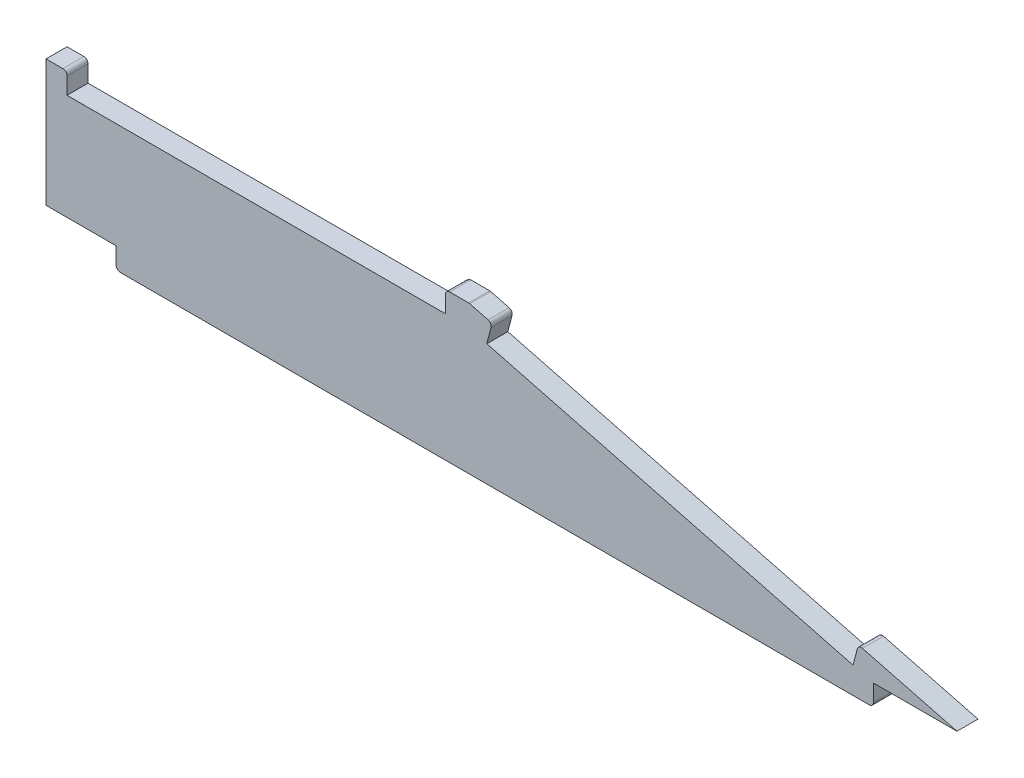
ISO-10303-21;
HEADER;
FILE_DESCRIPTION(('STEP AP214'),'2;1');
FILE_NAME('part.step','',(''),(''),'','','');
FILE_SCHEMA(('AUTOMOTIVE_DESIGN { 1 0 10303 214 1 1 1 1 }'));
ENDSEC;
DATA;
#1=APPLICATION_CONTEXT('core data for automotive mechanical design processes');
#2=APPLICATION_PROTOCOL_DEFINITION('international standard','automotive_design',2000,#1);
#3=PRODUCT_CONTEXT('',#1,'mechanical');
#4=PRODUCT('Part','Part','',(#3));
#5=PRODUCT_RELATED_PRODUCT_CATEGORY('part','',(#4));
#6=PRODUCT_DEFINITION_FORMATION('','',#4);
#7=PRODUCT_DEFINITION_CONTEXT('part definition',#1,'design');
#8=PRODUCT_DEFINITION('design','',#6,#7);
#9=PRODUCT_DEFINITION_SHAPE('','',#8);
#10=(LENGTH_UNIT() NAMED_UNIT(*) SI_UNIT(.MILLI.,.METRE.));
#11=(NAMED_UNIT(*) PLANE_ANGLE_UNIT() SI_UNIT($,.RADIAN.));
#12=(NAMED_UNIT(*) SI_UNIT($,.STERADIAN.) SOLID_ANGLE_UNIT());
#13=UNCERTAINTY_MEASURE_WITH_UNIT(LENGTH_MEASURE(1.E-05),#10,'distance_accuracy_value','');
#14=(GEOMETRIC_REPRESENTATION_CONTEXT(3) GLOBAL_UNCERTAINTY_ASSIGNED_CONTEXT((#13)) GLOBAL_UNIT_ASSIGNED_CONTEXT((#10,
#11,#12)) REPRESENTATION_CONTEXT('',''));
#15=CARTESIAN_POINT('',(0.,0.,0.));
#16=DIRECTION('',(0.,0.,1.));
#17=DIRECTION('',(1.,0.,0.));
#18=AXIS2_PLACEMENT_3D('',#15,#16,#17);
#19=CARTESIAN_POINT('',(124.40519424105,35.1608545699395,5.));
#20=DIRECTION('',(0.,-1.,0.));
#21=DIRECTION('',(0.,0.,-1.));
#22=AXIS2_PLACEMENT_3D('',#19,#20,#21);
#23=PLANE('',#22);
#24=DIRECTION('',(-1.,0.,0.));
#25=VECTOR('',#24,1.);
#26=CARTESIAN_POINT('',(124.40519424105,35.1608545699395,0.));
#27=LINE('',#26,#25);
#28=CARTESIAN_POINT('',(129.916638141311,35.1608545699395,0.));
#29=VERTEX_POINT('',#28);
#30=CARTESIAN_POINT('',(125.40519424105,35.1608545699395,0.));
#31=VERTEX_POINT('',#30);
#32=EDGE_CURVE('E255',#29,#31,#27,.T.);
#33=ORIENTED_EDGE('',*,*,#32,.T.);
#34=DIRECTION('',(0.,0.,-1.));
#35=VECTOR('',#34,1.);
#36=CARTESIAN_POINT('',(125.40519424105,35.1608545699395,5.));
#37=LINE('',#36,#35);
#38=CARTESIAN_POINT('',(125.40519424105,35.1608545699395,5.));
#39=VERTEX_POINT('',#38);
#40=EDGE_CURVE('E358',#31,#39,#37,.F.);
#41=ORIENTED_EDGE('',*,*,#40,.T.);
#42=DIRECTION('',(-1.,0.,0.));
#43=VECTOR('',#42,1.);
#44=CARTESIAN_POINT('',(124.40519424105,35.1608545699395,5.));
#45=LINE('',#44,#43);
#46=CARTESIAN_POINT('',(129.916638141311,35.1608545699395,5.));
#47=VERTEX_POINT('',#46);
#48=EDGE_CURVE('E208',#47,#39,#45,.T.);
#49=ORIENTED_EDGE('',*,*,#48,.F.);
#50=DIRECTION('',(0.,0.,-1.));
#51=VECTOR('',#50,1.);
#52=CARTESIAN_POINT('',(129.916638141311,35.1608545699395,5.));
#53=LINE('',#52,#51);
#54=EDGE_CURVE('E355',#47,#29,#53,.T.);
#55=ORIENTED_EDGE('',*,*,#54,.T.);
#56=EDGE_LOOP('',(#33,#41,#49,#55));
#57=FACE_BOUND('',#56,.T.);
#58=ADVANCED_FACE('F40',(#57),#23,.F.);
#59=CARTESIAN_POINT('',(124.40519424105,35.1608545699395,5.));
#60=DIRECTION('',(1.,0.,0.));
#61=DIRECTION('',(0.,0.,-1.));
#62=AXIS2_PLACEMENT_3D('',#59,#60,#61);
#63=PLANE('',#62);
#64=DIRECTION('',(0.,-1.,0.));
#65=VECTOR('',#64,1.);
#66=CARTESIAN_POINT('',(124.40519424105,35.1608545699395,5.));
#67=LINE('',#66,#65);
#68=CARTESIAN_POINT('',(124.40519424105,34.1608545699395,5.));
#69=VERTEX_POINT('',#68);
#70=CARTESIAN_POINT('',(124.40519424105,30.1608545699395,5.));
#71=VERTEX_POINT('',#70);
#72=EDGE_CURVE('E194',#69,#71,#67,.T.);
#73=ORIENTED_EDGE('',*,*,#72,.F.);
#74=DIRECTION('',(0.,0.,-1.));
#75=VECTOR('',#74,1.);
#76=CARTESIAN_POINT('',(124.40519424105,34.1608545699395,5.));
#77=LINE('',#76,#75);
#78=CARTESIAN_POINT('',(124.40519424105,34.1608545699395,0.));
#79=VERTEX_POINT('',#78);
#80=EDGE_CURVE('E353',#69,#79,#77,.T.);
#81=ORIENTED_EDGE('',*,*,#80,.T.);
#82=DIRECTION('',(0.,-1.,0.));
#83=VECTOR('',#82,1.);
#84=CARTESIAN_POINT('',(124.40519424105,35.1608545699395,0.));
#85=LINE('',#84,#83);
#86=CARTESIAN_POINT('',(124.40519424105,30.1608545699395,0.));
#87=VERTEX_POINT('',#86);
#88=EDGE_CURVE('E214',#79,#87,#85,.T.);
#89=ORIENTED_EDGE('',*,*,#88,.T.);
#90=DIRECTION('',(0.,0.,-1.));
#91=VECTOR('',#90,1.);
#92=CARTESIAN_POINT('',(124.40519424105,30.1608545699395,5.));
#93=LINE('',#92,#91);
#94=EDGE_CURVE('E211',#71,#87,#93,.T.);
#95=ORIENTED_EDGE('',*,*,#94,.F.);
#96=EDGE_LOOP('',(#73,#81,#89,#95));
#97=FACE_BOUND('',#96,.T.);
#98=ADVANCED_FACE('F212',(#97),#63,.F.);
#99=CARTESIAN_POINT('',(34.4051942410499,30.1608545699394,5.));
#100=DIRECTION('',(0.,-1.,0.));
#101=DIRECTION('',(1.,0.,0.));
#102=AXIS2_PLACEMENT_3D('',#99,#100,#101);
#103=PLANE('',#102);
#104=DIRECTION('',(-1.,0.,0.));
#105=VECTOR('',#104,1.);
#106=CARTESIAN_POINT('',(34.4051942410499,30.1608545699394,0.));
#107=LINE('',#106,#105);
#108=CARTESIAN_POINT('',(34.4051942410499,30.1608545699394,0.));
#109=VERTEX_POINT('',#108);
#110=EDGE_CURVE('E259',#87,#109,#107,.T.);
#111=ORIENTED_EDGE('',*,*,#110,.T.);
#112=DIRECTION('',(0.,0.,-1.));
#113=VECTOR('',#112,1.);
#114=CARTESIAN_POINT('',(34.4051942410499,30.1608545699394,5.));
#115=LINE('',#114,#113);
#116=CARTESIAN_POINT('',(34.4051942410499,30.1608545699394,5.));
#117=VERTEX_POINT('',#116);
#118=EDGE_CURVE('E218',#117,#109,#115,.T.);
#119=ORIENTED_EDGE('',*,*,#118,.F.);
#120=DIRECTION('',(-1.,0.,0.));
#121=VECTOR('',#120,1.);
#122=CARTESIAN_POINT('',(34.4051942410499,30.1608545699394,5.));
#123=LINE('',#122,#121);
#124=EDGE_CURVE('E200',#71,#117,#123,.T.);
#125=ORIENTED_EDGE('',*,*,#124,.F.);
#126=ORIENTED_EDGE('',*,*,#94,.T.);
#127=EDGE_LOOP('',(#111,#119,#125,#126));
#128=FACE_BOUND('',#127,.T.);
#129=ADVANCED_FACE('F220',(#128),#103,.F.);
#130=CARTESIAN_POINT('',(34.4051942410499,35.1608545699395,5.));
#131=DIRECTION('',(-1.,0.,0.));
#132=DIRECTION('',(0.,0.,1.));
#133=AXIS2_PLACEMENT_3D('',#130,#131,#132);
#134=PLANE('',#133);
#135=DIRECTION('',(0.,1.,0.));
#136=VECTOR('',#135,1.);
#137=CARTESIAN_POINT('',(34.4051942410499,35.1608545699395,0.));
#138=LINE('',#137,#136);
#139=CARTESIAN_POINT('',(34.4051942410499,34.1608545699395,0.));
#140=VERTEX_POINT('',#139);
#141=EDGE_CURVE('E261',#109,#140,#138,.T.);
#142=ORIENTED_EDGE('',*,*,#141,.T.);
#143=DIRECTION('',(0.,0.,-1.));
#144=VECTOR('',#143,1.);
#145=CARTESIAN_POINT('',(34.4051942410499,34.1608545699395,5.));
#146=LINE('',#145,#144);
#147=CARTESIAN_POINT('',(34.4051942410499,34.1608545699395,5.));
#148=VERTEX_POINT('',#147);
#149=EDGE_CURVE('E351',#140,#148,#146,.F.);
#150=ORIENTED_EDGE('',*,*,#149,.T.);
#151=DIRECTION('',(0.,1.,0.));
#152=VECTOR('',#151,1.);
#153=CARTESIAN_POINT('',(34.4051942410499,35.1608545699395,5.));
#154=LINE('',#153,#152);
#155=EDGE_CURVE('E223',#117,#148,#154,.T.);
#156=ORIENTED_EDGE('',*,*,#155,.F.);
#157=ORIENTED_EDGE('',*,*,#118,.T.);
#158=EDGE_LOOP('',(#142,#150,#156,#157));
#159=FACE_BOUND('',#158,.T.);
#160=ADVANCED_FACE('F405',(#159),#134,.F.);
#161=CARTESIAN_POINT('',(34.4051942410499,35.1608545699395,5.));
#162=DIRECTION('',(0.,-1.,0.));
#163=DIRECTION('',(0.,0.,-1.));
#164=AXIS2_PLACEMENT_3D('',#161,#162,#163);
#165=PLANE('',#164);
#166=DIRECTION('',(-1.,0.,0.));
#167=VECTOR('',#166,1.);
#168=CARTESIAN_POINT('',(34.4051942410499,35.1608545699395,5.));
#169=LINE('',#168,#167);
#170=CARTESIAN_POINT('',(33.4051942410499,35.1608545699395,5.));
#171=VERTEX_POINT('',#170);
#172=CARTESIAN_POINT('',(29.4051942410499,35.1608545699395,5.));
#173=VERTEX_POINT('',#172);
#174=EDGE_CURVE('E225',#171,#173,#169,.T.);
#175=ORIENTED_EDGE('',*,*,#174,.F.);
#176=DIRECTION('',(0.,0.,-1.));
#177=VECTOR('',#176,1.);
#178=CARTESIAN_POINT('',(33.4051942410499,35.1608545699395,5.));
#179=LINE('',#178,#177);
#180=CARTESIAN_POINT('',(33.4051942410499,35.1608545699395,0.));
#181=VERTEX_POINT('',#180);
#182=EDGE_CURVE('E348',#171,#181,#179,.T.);
#183=ORIENTED_EDGE('',*,*,#182,.T.);
#184=DIRECTION('',(-1.,0.,0.));
#185=VECTOR('',#184,1.);
#186=CARTESIAN_POINT('',(34.4051942410499,35.1608545699395,0.));
#187=LINE('',#186,#185);
#188=CARTESIAN_POINT('',(29.4051942410499,35.1608545699395,0.));
#189=VERTEX_POINT('',#188);
#190=EDGE_CURVE('E264',#181,#189,#187,.T.);
#191=ORIENTED_EDGE('',*,*,#190,.T.);
#192=DIRECTION('',(0.,0.,-1.));
#193=VECTOR('',#192,1.);
#194=CARTESIAN_POINT('',(29.4051942410499,35.1608545699395,5.));
#195=LINE('',#194,#193);
#196=EDGE_CURVE('E309',#173,#189,#195,.T.);
#197=ORIENTED_EDGE('',*,*,#196,.F.);
#198=EDGE_LOOP('',(#175,#183,#191,#197));
#199=FACE_BOUND('',#198,.T.);
#200=ADVANCED_FACE('F414',(#199),#165,.F.);
#201=CARTESIAN_POINT('',(29.4051942410499,35.1608545699395,5.));
#202=DIRECTION('',(1.,0.,0.));
#203=DIRECTION('',(0.,1.,0.));
#204=AXIS2_PLACEMENT_3D('',#201,#202,#203);
#205=PLANE('',#204);
#206=DIRECTION('',(0.,-1.,0.));
#207=VECTOR('',#206,1.);
#208=CARTESIAN_POINT('',(29.4051942410499,35.1608545699395,0.));
#209=LINE('',#208,#207);
#210=CARTESIAN_POINT('',(29.4051942410499,5.00000000000002,0.));
#211=VERTEX_POINT('',#210);
#212=EDGE_CURVE('E266',#189,#211,#209,.T.);
#213=ORIENTED_EDGE('',*,*,#212,.T.);
#214=DIRECTION('',(0.,0.,-1.));
#215=VECTOR('',#214,1.);
#216=CARTESIAN_POINT('',(29.4051942410499,5.00000000000002,5.));
#217=LINE('',#216,#215);
#218=CARTESIAN_POINT('',(29.4051942410499,5.00000000000002,5.));
#219=VERTEX_POINT('',#218);
#220=EDGE_CURVE('E306',#219,#211,#217,.T.);
#221=ORIENTED_EDGE('',*,*,#220,.F.);
#222=DIRECTION('',(0.,-1.,0.));
#223=VECTOR('',#222,1.);
#224=CARTESIAN_POINT('',(29.4051942410499,35.1608545699395,5.));
#225=LINE('',#224,#223);
#226=EDGE_CURVE('E230',#173,#219,#225,.T.);
#227=ORIENTED_EDGE('',*,*,#226,.F.);
#228=ORIENTED_EDGE('',*,*,#196,.T.);
#229=EDGE_LOOP('',(#213,#221,#227,#228));
#230=FACE_BOUND('',#229,.T.);
#231=ADVANCED_FACE('F421',(#230),#205,.F.);
#232=CARTESIAN_POINT('',(29.4051942410499,5.00000000000002,5.));
#233=DIRECTION('',(0.,1.,0.));
#234=DIRECTION('',(0.,0.,1.));
#235=AXIS2_PLACEMENT_3D('',#232,#233,#234);
#236=PLANE('',#235);
#237=DIRECTION('',(1.,0.,0.));
#238=VECTOR('',#237,1.);
#239=CARTESIAN_POINT('',(29.4051942410499,5.00000000000002,0.));
#240=LINE('',#239,#238);
#241=CARTESIAN_POINT('',(46.0881028422609,5.00000000000002,0.));
#242=VERTEX_POINT('',#241);
#243=EDGE_CURVE('E268',#211,#242,#240,.T.);
#244=ORIENTED_EDGE('',*,*,#243,.T.);
#245=DIRECTION('',(0.,0.,-1.));
#246=VECTOR('',#245,1.);
#247=CARTESIAN_POINT('',(46.0881028422609,5.00000000000002,5.));
#248=LINE('',#247,#246);
#249=CARTESIAN_POINT('',(46.0881028422609,5.00000000000002,5.));
#250=VERTEX_POINT('',#249);
#251=EDGE_CURVE('E303',#250,#242,#248,.T.);
#252=ORIENTED_EDGE('',*,*,#251,.F.);
#253=DIRECTION('',(1.,0.,0.));
#254=VECTOR('',#253,1.);
#255=CARTESIAN_POINT('',(29.4051942410499,5.00000000000002,5.));
#256=LINE('',#255,#254);
#257=EDGE_CURVE('E232',#219,#250,#256,.T.);
#258=ORIENTED_EDGE('',*,*,#257,.F.);
#259=ORIENTED_EDGE('',*,*,#220,.T.);
#260=EDGE_LOOP('',(#244,#252,#258,#259));
#261=FACE_BOUND('',#260,.T.);
#262=ADVANCED_FACE('F425',(#261),#236,.F.);
#263=CARTESIAN_POINT('',(46.0881028422609,5.00000000000002,5.));
#264=DIRECTION('',(1.,0.,0.));
#265=DIRECTION('',(0.,0.,-1.));
#266=AXIS2_PLACEMENT_3D('',#263,#264,#265);
#267=PLANE('',#266);
#268=DIRECTION('',(0.,-1.,0.));
#269=VECTOR('',#268,1.);
#270=CARTESIAN_POINT('',(46.0881028422609,5.00000000000002,0.));
#271=LINE('',#270,#269);
#272=CARTESIAN_POINT('',(46.0881028422609,1.00000000000003,0.));
#273=VERTEX_POINT('',#272);
#274=EDGE_CURVE('E270',#242,#273,#271,.T.);
#275=ORIENTED_EDGE('',*,*,#274,.T.);
#276=DIRECTION('',(0.,0.,-1.));
#277=VECTOR('',#276,1.);
#278=CARTESIAN_POINT('',(46.0881028422609,1.00000000000003,5.));
#279=LINE('',#278,#277);
#280=CARTESIAN_POINT('',(46.0881028422609,1.00000000000003,5.));
#281=VERTEX_POINT('',#280);
#282=EDGE_CURVE('E346',#273,#281,#279,.F.);
#283=ORIENTED_EDGE('',*,*,#282,.T.);
#284=DIRECTION('',(0.,-1.,0.));
#285=VECTOR('',#284,1.);
#286=CARTESIAN_POINT('',(46.0881028422609,5.00000000000002,5.));
#287=LINE('',#286,#285);
#288=EDGE_CURVE('E234',#250,#281,#287,.T.);
#289=ORIENTED_EDGE('',*,*,#288,.F.);
#290=ORIENTED_EDGE('',*,*,#251,.T.);
#291=EDGE_LOOP('',(#275,#283,#289,#290));
#292=FACE_BOUND('',#291,.T.);
#293=ADVANCED_FACE('F586',(#292),#267,.F.);
#294=CARTESIAN_POINT('',(46.0881028422609,0.,5.));
#295=DIRECTION('',(0.,1.,0.));
#296=DIRECTION('',(0.,0.,1.));
#297=AXIS2_PLACEMENT_3D('',#294,#295,#296);
#298=PLANE('',#297);
#299=DIRECTION('',(1.,0.,0.));
#300=VECTOR('',#299,1.);
#301=CARTESIAN_POINT('',(46.0881028422609,0.,0.));
#302=LINE('',#301,#300);
#303=CARTESIAN_POINT('',(47.0881028422609,0.,0.));
#304=VERTEX_POINT('',#303);
#305=CARTESIAN_POINT('',(225.188102842261,0.,0.));
#306=VERTEX_POINT('',#305);
#307=EDGE_CURVE('E273',#304,#306,#302,.T.);
#308=ORIENTED_EDGE('',*,*,#307,.T.);
#309=DIRECTION('',(0.,0.,-1.));
#310=VECTOR('',#309,1.);
#311=CARTESIAN_POINT('',(225.188102842261,0.,5.));
#312=LINE('',#311,#310);
#313=CARTESIAN_POINT('',(225.188102842261,0.,5.));
#314=VERTEX_POINT('',#313);
#315=EDGE_CURVE('E332',#306,#314,#312,.F.);
#316=ORIENTED_EDGE('',*,*,#315,.T.);
#317=DIRECTION('',(1.,0.,0.));
#318=VECTOR('',#317,1.);
#319=CARTESIAN_POINT('',(46.0881028422609,0.,5.));
#320=LINE('',#319,#318);
#321=CARTESIAN_POINT('',(47.0881028422609,0.,5.));
#322=VERTEX_POINT('',#321);
#323=EDGE_CURVE('E237',#322,#314,#320,.T.);
#324=ORIENTED_EDGE('',*,*,#323,.F.);
#325=DIRECTION('',(0.,0.,-1.));
#326=VECTOR('',#325,1.);
#327=CARTESIAN_POINT('',(47.0881028422609,0.,5.));
#328=LINE('',#327,#326);
#329=EDGE_CURVE('E329',#322,#304,#328,.T.);
#330=ORIENTED_EDGE('',*,*,#329,.T.);
#331=EDGE_LOOP('',(#308,#316,#324,#330));
#332=FACE_BOUND('',#331,.T.);
#333=ADVANCED_FACE('F437',(#332),#298,.F.);
#334=CARTESIAN_POINT('',(226.188102842261,5.00000000000002,5.));
#335=DIRECTION('',(-1.,0.,0.));
#336=DIRECTION('',(0.,0.,1.));
#337=AXIS2_PLACEMENT_3D('',#334,#335,#336);
#338=PLANE('',#337);
#339=DIRECTION('',(0.,1.,0.));
#340=VECTOR('',#339,1.);
#341=CARTESIAN_POINT('',(226.188102842261,5.00000000000002,5.));
#342=LINE('',#341,#340);
#343=CARTESIAN_POINT('',(226.188102842261,1.00000000000003,5.));
#344=VERTEX_POINT('',#343);
#345=CARTESIAN_POINT('',(226.188102842261,5.00000000000002,5.));
#346=VERTEX_POINT('',#345);
#347=EDGE_CURVE('E239',#344,#346,#342,.T.);
#348=ORIENTED_EDGE('',*,*,#347,.F.);
#349=DIRECTION('',(0.,0.,-1.));
#350=VECTOR('',#349,1.);
#351=CARTESIAN_POINT('',(226.188102842261,1.00000000000003,5.));
#352=LINE('',#351,#350);
#353=CARTESIAN_POINT('',(226.188102842261,1.00000000000003,0.));
#354=VERTEX_POINT('',#353);
#355=EDGE_CURVE('E217',#344,#354,#352,.T.);
#356=ORIENTED_EDGE('',*,*,#355,.T.);
#357=DIRECTION('',(0.,1.,0.));
#358=VECTOR('',#357,1.);
#359=CARTESIAN_POINT('',(226.188102842261,5.00000000000002,0.));
#360=LINE('',#359,#358);
#361=CARTESIAN_POINT('',(226.188102842261,5.00000000000002,0.));
#362=VERTEX_POINT('',#361);
#363=EDGE_CURVE('E276',#354,#362,#360,.T.);
#364=ORIENTED_EDGE('',*,*,#363,.T.);
#365=DIRECTION('',(0.,0.,-1.));
#366=VECTOR('',#365,1.);
#367=CARTESIAN_POINT('',(226.188102842261,5.00000000000002,5.));
#368=LINE('',#367,#366);
#369=EDGE_CURVE('E300',#346,#362,#368,.T.);
#370=ORIENTED_EDGE('',*,*,#369,.F.);
#371=EDGE_LOOP('',(#348,#356,#364,#370));
#372=FACE_BOUND('',#371,.T.);
#373=ADVANCED_FACE('F446',(#372),#338,.F.);
#374=CARTESIAN_POINT('',(226.188102842261,5.00000000000002,5.));
#375=DIRECTION('',(0.,1.,0.));
#376=DIRECTION('',(0.,0.,1.));
#377=AXIS2_PLACEMENT_3D('',#374,#375,#376);
#378=PLANE('',#377);
#379=DIRECTION('',(1.,0.,0.));
#380=VECTOR('',#379,1.);
#381=CARTESIAN_POINT('',(226.188102842261,5.00000000000002,0.));
#382=LINE('',#381,#380);
#383=CARTESIAN_POINT('',(246.060241867196,5.00000000000002,0.));
#384=VERTEX_POINT('',#383);
#385=EDGE_CURVE('E278',#362,#384,#382,.T.);
#386=ORIENTED_EDGE('',*,*,#385,.T.);
#387=DIRECTION('',(0.,0.,-1.));
#388=VECTOR('',#387,1.);
#389=CARTESIAN_POINT('',(246.060241867196,5.00000000000002,5.));
#390=LINE('',#389,#388);
#391=CARTESIAN_POINT('',(246.060241867196,5.00000000000002,5.));
#392=VERTEX_POINT('',#391);
#393=EDGE_CURVE('E297',#392,#384,#390,.T.);
#394=ORIENTED_EDGE('',*,*,#393,.F.);
#395=DIRECTION('',(1.,0.,0.));
#396=VECTOR('',#395,1.);
#397=CARTESIAN_POINT('',(226.188102842261,5.00000000000002,5.));
#398=LINE('',#397,#396);
#399=EDGE_CURVE('E241',#346,#392,#398,.T.);
#400=ORIENTED_EDGE('',*,*,#399,.F.);
#401=ORIENTED_EDGE('',*,*,#369,.T.);
#402=EDGE_LOOP('',(#386,#394,#400,#401));
#403=FACE_BOUND('',#402,.T.);
#404=ADVANCED_FACE('F452',(#403),#378,.F.);
#405=CARTESIAN_POINT('',(222.607000140697,11.0971881585575,5.));
#406=DIRECTION('',(-0.251608545699394,-0.96782908601211,0.));
#407=DIRECTION('',(0.96782908601211,-0.251608545699394,0.));
#408=AXIS2_PLACEMENT_3D('',#405,#406,#407);
#409=PLANE('',#408);
#410=DIRECTION('',(-0.96782908601211,0.251608545699394,0.));
#411=VECTOR('',#410,1.);
#412=CARTESIAN_POINT('',(222.607000140697,11.0971881585575,0.));
#413=LINE('',#412,#411);
#414=CARTESIAN_POINT('',(223.574829226709,10.8455796128581,0.));
#415=VERTEX_POINT('',#414);
#416=EDGE_CURVE('E280',#384,#415,#413,.T.);
#417=ORIENTED_EDGE('',*,*,#416,.T.);
#418=DIRECTION('',(0.,0.,-1.));
#419=VECTOR('',#418,1.);
#420=CARTESIAN_POINT('',(223.574829226709,10.8455796128581,5.));
#421=LINE('',#420,#419);
#422=CARTESIAN_POINT('',(223.574829226709,10.8455796128581,5.));
#423=VERTEX_POINT('',#422);
#424=EDGE_CURVE('E11',#415,#423,#421,.F.);
#425=ORIENTED_EDGE('',*,*,#424,.T.);
#426=DIRECTION('',(-0.96782908601211,0.251608545699394,0.));
#427=VECTOR('',#426,1.);
#428=CARTESIAN_POINT('',(222.607000140697,11.0971881585575,5.));
#429=LINE('',#428,#427);
#430=EDGE_CURVE('E243',#392,#423,#429,.T.);
#431=ORIENTED_EDGE('',*,*,#430,.F.);
#432=ORIENTED_EDGE('',*,*,#393,.T.);
#433=EDGE_LOOP('',(#417,#425,#431,#432));
#434=FACE_BOUND('',#433,.T.);
#435=ADVANCED_FACE('F454',(#434),#409,.F.);
#436=CARTESIAN_POINT('',(221.3489574122,6.25804272849701,5.));
#437=DIRECTION('',(0.96782908601211,-0.251608545699395,0.));
#438=DIRECTION('',(0.251608545699395,0.96782908601211,0.));
#439=AXIS2_PLACEMENT_3D('',#436,#437,#438);
#440=PLANE('',#439);
#441=DIRECTION('',(-0.251608545699395,-0.96782908601211,0.));
#442=VECTOR('',#441,1.);
#443=CARTESIAN_POINT('',(221.3489574122,6.25804272849701,5.));
#444=LINE('',#443,#442);
#445=CARTESIAN_POINT('',(222.355391594998,10.1293590725454,5.));
#446=VERTEX_POINT('',#445);
#447=CARTESIAN_POINT('',(221.3489574122,6.25804272849701,5.));
#448=VERTEX_POINT('',#447);
#449=EDGE_CURVE('E246',#446,#448,#444,.T.);
#450=ORIENTED_EDGE('',*,*,#449,.F.);
#451=DIRECTION('',(0.,0.,-1.));
#452=VECTOR('',#451,1.);
#453=CARTESIAN_POINT('',(222.355391594998,10.1293590725454,5.));
#454=LINE('',#453,#452);
#455=CARTESIAN_POINT('',(222.355391594998,10.1293590725454,0.));
#456=VERTEX_POINT('',#455);
#457=EDGE_CURVE('E48',#446,#456,#454,.T.);
#458=ORIENTED_EDGE('',*,*,#457,.T.);
#459=DIRECTION('',(-0.251608545699395,-0.96782908601211,0.));
#460=VECTOR('',#459,1.);
#461=CARTESIAN_POINT('',(221.3489574122,6.25804272849701,0.));
#462=LINE('',#461,#460);
#463=CARTESIAN_POINT('',(221.3489574122,6.25804272849701,0.));
#464=VERTEX_POINT('',#463);
#465=EDGE_CURVE('E283',#456,#464,#462,.T.);
#466=ORIENTED_EDGE('',*,*,#465,.T.);
#467=DIRECTION('',(0.,0.,-1.));
#468=VECTOR('',#467,1.);
#469=CARTESIAN_POINT('',(221.3489574122,6.25804272849701,5.));
#470=LINE('',#469,#468);
#471=EDGE_CURVE('E294',#448,#464,#470,.T.);
#472=ORIENTED_EDGE('',*,*,#471,.F.);
#473=EDGE_LOOP('',(#450,#458,#466,#472));
#474=FACE_BOUND('',#473,.T.);
#475=ADVANCED_FACE('F370',(#474),#440,.F.);
#476=CARTESIAN_POINT('',(134.24433967111,28.9028118414425,5.));
#477=DIRECTION('',(-0.251608545699394,-0.96782908601211,0.));
#478=DIRECTION('',(0.96782908601211,-0.251608545699394,0.));
#479=AXIS2_PLACEMENT_3D('',#476,#477,#478);
#480=PLANE('',#479);
#481=DIRECTION('',(-0.96782908601211,0.251608545699394,0.));
#482=VECTOR('',#481,1.);
#483=CARTESIAN_POINT('',(134.24433967111,28.9028118414425,0.));
#484=LINE('',#483,#482);
#485=CARTESIAN_POINT('',(134.24433967111,28.9028118414425,0.));
#486=VERTEX_POINT('',#485);
#487=EDGE_CURVE('E285',#464,#486,#484,.T.);
#488=ORIENTED_EDGE('',*,*,#487,.T.);
#489=DIRECTION('',(0.,0.,-1.));
#490=VECTOR('',#489,1.);
#491=CARTESIAN_POINT('',(134.24433967111,28.9028118414425,5.));
#492=LINE('',#491,#490);
#493=CARTESIAN_POINT('',(134.24433967111,28.9028118414425,5.));
#494=VERTEX_POINT('',#493);
#495=EDGE_CURVE('E254',#494,#486,#492,.T.);
#496=ORIENTED_EDGE('',*,*,#495,.F.);
#497=DIRECTION('',(-0.96782908601211,0.251608545699394,0.));
#498=VECTOR('',#497,1.);
#499=CARTESIAN_POINT('',(134.24433967111,28.9028118414425,5.));
#500=LINE('',#499,#498);
#501=EDGE_CURVE('E248',#448,#494,#500,.T.);
#502=ORIENTED_EDGE('',*,*,#501,.F.);
#503=ORIENTED_EDGE('',*,*,#471,.T.);
#504=EDGE_LOOP('',(#488,#496,#502,#503));
#505=FACE_BOUND('',#504,.T.);
#506=ADVANCED_FACE('F382',(#505),#480,.F.);
#507=CARTESIAN_POINT('',(134.24433967111,28.9028118414425,5.));
#508=DIRECTION('',(-0.96782908601211,0.251608545699395,0.));
#509=DIRECTION('',(-0.251608545699395,-0.96782908601211,0.));
#510=AXIS2_PLACEMENT_3D('',#507,#508,#509);
#511=PLANE('',#510);
#512=DIRECTION('',(0.251608545699395,0.96782908601211,0.));
#513=VECTOR('',#512,1.);
#514=CARTESIAN_POINT('',(134.24433967111,28.9028118414425,0.));
#515=LINE('',#514,#513);
#516=CARTESIAN_POINT('',(135.250773853908,32.7741281854909,0.));
#517=VERTEX_POINT('',#516);
#518=EDGE_CURVE('E287',#486,#517,#515,.T.);
#519=ORIENTED_EDGE('',*,*,#518,.T.);
#520=DIRECTION('',(0.,0.,-1.));
#521=VECTOR('',#520,1.);
#522=CARTESIAN_POINT('',(135.250773853908,32.7741281854909,5.));
#523=LINE('',#522,#521);
#524=CARTESIAN_POINT('',(135.250773853908,32.7741281854909,5.));
#525=VERTEX_POINT('',#524);
#526=EDGE_CURVE('E364',#517,#525,#523,.F.);
#527=ORIENTED_EDGE('',*,*,#526,.T.);
#528=DIRECTION('',(0.251608545699395,0.96782908601211,0.));
#529=VECTOR('',#528,1.);
#530=CARTESIAN_POINT('',(134.24433967111,28.9028118414425,5.));
#531=LINE('',#530,#529);
#532=EDGE_CURVE('E250',#494,#525,#531,.T.);
#533=ORIENTED_EDGE('',*,*,#532,.F.);
#534=ORIENTED_EDGE('',*,*,#495,.T.);
#535=EDGE_LOOP('',(#519,#527,#533,#534));
#536=FACE_BOUND('',#535,.T.);
#537=ADVANCED_FACE('F386',(#536),#511,.F.);
#538=CARTESIAN_POINT('',(135.502382399607,33.741957271503,5.));
#539=DIRECTION('',(-0.251608545699393,-0.96782908601211,0.));
#540=DIRECTION('',(0.96782908601211,-0.251608545699393,0.));
#541=AXIS2_PLACEMENT_3D('',#538,#539,#540);
#542=PLANE('',#541);
#543=DIRECTION('',(-0.96782908601211,0.251608545699393,0.));
#544=VECTOR('',#543,1.);
#545=CARTESIAN_POINT('',(135.502382399607,33.741957271503,0.));
#546=LINE('',#545,#544);
#547=CARTESIAN_POINT('',(134.534553313595,33.9935658172024,0.));
#548=VERTEX_POINT('',#547);
#549=CARTESIAN_POINT('',(130.16824668701,35.1286836559516,0.));
#550=VERTEX_POINT('',#549);
#551=EDGE_CURVE('E290',#548,#550,#546,.T.);
#552=ORIENTED_EDGE('',*,*,#551,.T.);
#553=DIRECTION('',(0.,0.,-1.));
#554=VECTOR('',#553,1.);
#555=CARTESIAN_POINT('',(130.16824668701,35.1286836559516,5.));
#556=LINE('',#555,#554);
#557=CARTESIAN_POINT('',(130.16824668701,35.1286836559516,5.));
#558=VERTEX_POINT('',#557);
#559=EDGE_CURVE('E55',#550,#558,#556,.F.);
#560=ORIENTED_EDGE('',*,*,#559,.T.);
#561=DIRECTION('',(-0.96782908601211,0.251608545699393,0.));
#562=VECTOR('',#561,1.);
#563=CARTESIAN_POINT('',(135.502382399607,33.741957271503,5.));
#564=LINE('',#563,#562);
#565=CARTESIAN_POINT('',(134.534553313595,33.9935658172024,5.));
#566=VERTEX_POINT('',#565);
#567=EDGE_CURVE('E252',#566,#558,#564,.T.);
#568=ORIENTED_EDGE('',*,*,#567,.F.);
#569=DIRECTION('',(0.,0.,-1.));
#570=VECTOR('',#569,1.);
#571=CARTESIAN_POINT('',(134.534553313595,33.9935658172024,5.));
#572=LINE('',#571,#570);
#573=EDGE_CURVE('E360',#566,#548,#572,.T.);
#574=ORIENTED_EDGE('',*,*,#573,.T.);
#575=EDGE_LOOP('',(#552,#560,#568,#574));
#576=FACE_BOUND('',#575,.T.);
#577=ADVANCED_FACE('F392',(#576),#542,.F.);
#578=CARTESIAN_POINT('',(0.,0.,5.));
#579=DIRECTION('',(0.,0.,-1.));
#580=DIRECTION('',(-1.,0.,0.));
#581=AXIS2_PLACEMENT_3D('',#578,#579,#580);
#582=PLANE('',#581);
#583=ORIENTED_EDGE('',*,*,#323,.T.);
#584=CARTESIAN_POINT('',(225.188102842261,1.00000000000003,5.));
#585=DIRECTION('',(0.,0.,-1.));
#586=DIRECTION('',(-1.,0.,0.));
#587=AXIS2_PLACEMENT_3D('',#584,#585,#586);
#588=CIRCLE('',#587,1.);
#589=EDGE_CURVE('E344',#314,#344,#588,.F.);
#590=ORIENTED_EDGE('',*,*,#589,.T.);
#591=ORIENTED_EDGE('',*,*,#347,.T.);
#592=ORIENTED_EDGE('',*,*,#399,.T.);
#593=ORIENTED_EDGE('',*,*,#430,.T.);
#594=CARTESIAN_POINT('',(223.32322068101,9.87775052684604,5.));
#595=DIRECTION('',(0.,0.,-1.));
#596=DIRECTION('',(-1.,0.,0.));
#597=AXIS2_PLACEMENT_3D('',#594,#595,#596);
#598=CIRCLE('',#597,1.);
#599=EDGE_CURVE('E334',#423,#446,#598,.F.);
#600=ORIENTED_EDGE('',*,*,#599,.T.);
#601=ORIENTED_EDGE('',*,*,#449,.T.);
#602=ORIENTED_EDGE('',*,*,#501,.T.);
#603=ORIENTED_EDGE('',*,*,#532,.T.);
#604=CARTESIAN_POINT('',(134.282944767896,33.0257367311903,5.));
#605=DIRECTION('',(0.,0.,-1.));
#606=DIRECTION('',(-1.,0.,0.));
#607=AXIS2_PLACEMENT_3D('',#604,#605,#606);
#608=CIRCLE('',#607,1.);
#609=EDGE_CURVE('E62',#525,#566,#608,.F.);
#610=ORIENTED_EDGE('',*,*,#609,.T.);
#611=ORIENTED_EDGE('',*,*,#567,.T.);
#612=CARTESIAN_POINT('',(129.916638141311,34.1608545699395,5.));
#613=DIRECTION('',(0.,0.,-1.));
#614=DIRECTION('',(-1.,0.,0.));
#615=AXIS2_PLACEMENT_3D('',#612,#613,#614);
#616=CIRCLE('',#615,1.);
#617=EDGE_CURVE('E337',#558,#47,#616,.F.);
#618=ORIENTED_EDGE('',*,*,#617,.T.);
#619=ORIENTED_EDGE('',*,*,#48,.T.);
#620=CARTESIAN_POINT('',(125.40519424105,34.1608545699395,5.));
#621=DIRECTION('',(0.,0.,-1.));
#622=DIRECTION('',(-1.,0.,0.));
#623=AXIS2_PLACEMENT_3D('',#620,#621,#622);
#624=CIRCLE('',#623,1.);
#625=EDGE_CURVE('E204',#39,#69,#624,.F.);
#626=ORIENTED_EDGE('',*,*,#625,.T.);
#627=ORIENTED_EDGE('',*,*,#72,.T.);
#628=ORIENTED_EDGE('',*,*,#124,.T.);
#629=ORIENTED_EDGE('',*,*,#155,.T.);
#630=CARTESIAN_POINT('',(33.4051942410499,34.1608545699395,5.));
#631=DIRECTION('',(0.,0.,-1.));
#632=DIRECTION('',(-1.,0.,0.));
#633=AXIS2_PLACEMENT_3D('',#630,#631,#632);
#634=CIRCLE('',#633,1.);
#635=EDGE_CURVE('E340',#148,#171,#634,.F.);
#636=ORIENTED_EDGE('',*,*,#635,.T.);
#637=ORIENTED_EDGE('',*,*,#174,.T.);
#638=ORIENTED_EDGE('',*,*,#226,.T.);
#639=ORIENTED_EDGE('',*,*,#257,.T.);
#640=ORIENTED_EDGE('',*,*,#288,.T.);
#641=CARTESIAN_POINT('',(47.0881028422609,1.00000000000003,5.));
#642=DIRECTION('',(0.,0.,-1.));
#643=DIRECTION('',(-1.,0.,0.));
#644=AXIS2_PLACEMENT_3D('',#641,#642,#643);
#645=CIRCLE('',#644,1.);
#646=EDGE_CURVE('E342',#281,#322,#645,.F.);
#647=ORIENTED_EDGE('',*,*,#646,.T.);
#648=EDGE_LOOP('',(#583,#590,#591,#592,#593,#600,#601,#602,#603,#610,#611,#618,#619,#626,#627,
#628,#629,#636,#637,#638,#639,#640,#647));
#649=FACE_BOUND('',#648,.T.);
#650=ADVANCED_FACE('F197',(#649),#582,.F.);
#651=CARTESIAN_POINT('',(0.,0.,0.));
#652=DIRECTION('',(0.,0.,-1.));
#653=DIRECTION('',(-1.,0.,0.));
#654=AXIS2_PLACEMENT_3D('',#651,#652,#653);
#655=PLANE('',#654);
#656=ORIENTED_EDGE('',*,*,#363,.F.);
#657=CARTESIAN_POINT('',(225.188102842261,1.00000000000003,0.));
#658=DIRECTION('',(0.,0.,-1.));
#659=DIRECTION('',(-1.,0.,0.));
#660=AXIS2_PLACEMENT_3D('',#657,#658,#659);
#661=CIRCLE('',#660,1.);
#662=EDGE_CURVE('E327',#354,#306,#661,.T.);
#663=ORIENTED_EDGE('',*,*,#662,.T.);
#664=ORIENTED_EDGE('',*,*,#307,.F.);
#665=CARTESIAN_POINT('',(47.0881028422609,1.00000000000003,0.));
#666=DIRECTION('',(0.,0.,-1.));
#667=DIRECTION('',(-1.,0.,0.));
#668=AXIS2_PLACEMENT_3D('',#665,#666,#667);
#669=CIRCLE('',#668,1.);
#670=EDGE_CURVE('E325',#304,#273,#669,.T.);
#671=ORIENTED_EDGE('',*,*,#670,.T.);
#672=ORIENTED_EDGE('',*,*,#274,.F.);
#673=ORIENTED_EDGE('',*,*,#243,.F.);
#674=ORIENTED_EDGE('',*,*,#212,.F.);
#675=ORIENTED_EDGE('',*,*,#190,.F.);
#676=CARTESIAN_POINT('',(33.4051942410499,34.1608545699395,0.));
#677=DIRECTION('',(0.,0.,-1.));
#678=DIRECTION('',(-1.,0.,0.));
#679=AXIS2_PLACEMENT_3D('',#676,#677,#678);
#680=CIRCLE('',#679,1.);
#681=EDGE_CURVE('E323',#181,#140,#680,.T.);
#682=ORIENTED_EDGE('',*,*,#681,.T.);
#683=ORIENTED_EDGE('',*,*,#141,.F.);
#684=ORIENTED_EDGE('',*,*,#110,.F.);
#685=ORIENTED_EDGE('',*,*,#88,.F.);
#686=CARTESIAN_POINT('',(125.40519424105,34.1608545699395,0.));
#687=DIRECTION('',(0.,0.,-1.));
#688=DIRECTION('',(-1.,0.,0.));
#689=AXIS2_PLACEMENT_3D('',#686,#687,#688);
#690=CIRCLE('',#689,1.);
#691=EDGE_CURVE('E321',#79,#31,#690,.T.);
#692=ORIENTED_EDGE('',*,*,#691,.T.);
#693=ORIENTED_EDGE('',*,*,#32,.F.);
#694=CARTESIAN_POINT('',(129.916638141311,34.1608545699395,0.));
#695=DIRECTION('',(0.,0.,-1.));
#696=DIRECTION('',(-1.,0.,0.));
#697=AXIS2_PLACEMENT_3D('',#694,#695,#696);
#698=CIRCLE('',#697,1.);
#699=EDGE_CURVE('E319',#29,#550,#698,.T.);
#700=ORIENTED_EDGE('',*,*,#699,.T.);
#701=ORIENTED_EDGE('',*,*,#551,.F.);
#702=CARTESIAN_POINT('',(134.282944767896,33.0257367311903,0.));
#703=DIRECTION('',(0.,0.,-1.));
#704=DIRECTION('',(-1.,0.,0.));
#705=AXIS2_PLACEMENT_3D('',#702,#703,#704);
#706=CIRCLE('',#705,1.);
#707=EDGE_CURVE('E317',#548,#517,#706,.T.);
#708=ORIENTED_EDGE('',*,*,#707,.T.);
#709=ORIENTED_EDGE('',*,*,#518,.F.);
#710=ORIENTED_EDGE('',*,*,#487,.F.);
#711=ORIENTED_EDGE('',*,*,#465,.F.);
#712=CARTESIAN_POINT('',(223.32322068101,9.87775052684604,0.));
#713=DIRECTION('',(0.,0.,-1.));
#714=DIRECTION('',(-1.,0.,0.));
#715=AXIS2_PLACEMENT_3D('',#712,#713,#714);
#716=CIRCLE('',#715,1.);
#717=EDGE_CURVE('E315',#456,#415,#716,.T.);
#718=ORIENTED_EDGE('',*,*,#717,.T.);
#719=ORIENTED_EDGE('',*,*,#416,.F.);
#720=ORIENTED_EDGE('',*,*,#385,.F.);
#721=EDGE_LOOP('',(#656,#663,#664,#671,#672,#673,#674,#675,#682,#683,#684,#685,#692,#693,#700,
#701,#708,#709,#710,#711,#718,#719,#720));
#722=FACE_BOUND('',#721,.T.);
#723=ADVANCED_FACE('F377',(#722),#655,.T.);
#724=CARTESIAN_POINT('',(225.188102842261,1.00000000000003,5.));
#725=DIRECTION('',(0.,0.,-1.));
#726=DIRECTION('',(-1.,0.,0.));
#727=AXIS2_PLACEMENT_3D('',#724,#725,#726);
#728=CYLINDRICAL_SURFACE('',#727,1.);
#729=ORIENTED_EDGE('',*,*,#589,.F.);
#730=ORIENTED_EDGE('',*,*,#315,.F.);
#731=ORIENTED_EDGE('',*,*,#662,.F.);
#732=ORIENTED_EDGE('',*,*,#355,.F.);
#733=EDGE_LOOP('',(#729,#730,#731,#732));
#734=FACE_BOUND('',#733,.T.);
#735=ADVANCED_FACE('F443',(#734),#728,.T.);
#736=CARTESIAN_POINT('',(47.0881028422609,1.00000000000003,5.));
#737=DIRECTION('',(0.,0.,-1.));
#738=DIRECTION('',(-1.,0.,0.));
#739=AXIS2_PLACEMENT_3D('',#736,#737,#738);
#740=CYLINDRICAL_SURFACE('',#739,1.);
#741=ORIENTED_EDGE('',*,*,#646,.F.);
#742=ORIENTED_EDGE('',*,*,#282,.F.);
#743=ORIENTED_EDGE('',*,*,#670,.F.);
#744=ORIENTED_EDGE('',*,*,#329,.F.);
#745=EDGE_LOOP('',(#741,#742,#743,#744));
#746=FACE_BOUND('',#745,.T.);
#747=ADVANCED_FACE('F434',(#746),#740,.T.);
#748=CARTESIAN_POINT('',(33.4051942410499,34.1608545699395,5.));
#749=DIRECTION('',(0.,0.,-1.));
#750=DIRECTION('',(-1.,0.,0.));
#751=AXIS2_PLACEMENT_3D('',#748,#749,#750);
#752=CYLINDRICAL_SURFACE('',#751,1.);
#753=ORIENTED_EDGE('',*,*,#635,.F.);
#754=ORIENTED_EDGE('',*,*,#149,.F.);
#755=ORIENTED_EDGE('',*,*,#681,.F.);
#756=ORIENTED_EDGE('',*,*,#182,.F.);
#757=EDGE_LOOP('',(#753,#754,#755,#756));
#758=FACE_BOUND('',#757,.T.);
#759=ADVANCED_FACE('F411',(#758),#752,.T.);
#760=CARTESIAN_POINT('',(125.40519424105,34.1608545699395,5.));
#761=DIRECTION('',(0.,0.,-1.));
#762=DIRECTION('',(-1.,0.,0.));
#763=AXIS2_PLACEMENT_3D('',#760,#761,#762);
#764=CYLINDRICAL_SURFACE('',#763,1.);
#765=ORIENTED_EDGE('',*,*,#625,.F.);
#766=ORIENTED_EDGE('',*,*,#40,.F.);
#767=ORIENTED_EDGE('',*,*,#691,.F.);
#768=ORIENTED_EDGE('',*,*,#80,.F.);
#769=EDGE_LOOP('',(#765,#766,#767,#768));
#770=FACE_BOUND('',#769,.T.);
#771=ADVANCED_FACE('F402',(#770),#764,.T.);
#772=CARTESIAN_POINT('',(129.916638141311,34.1608545699395,5.));
#773=DIRECTION('',(0.,0.,-1.));
#774=DIRECTION('',(-1.,0.,0.));
#775=AXIS2_PLACEMENT_3D('',#772,#773,#774);
#776=CYLINDRICAL_SURFACE('',#775,1.);
#777=ORIENTED_EDGE('',*,*,#617,.F.);
#778=ORIENTED_EDGE('',*,*,#559,.F.);
#779=ORIENTED_EDGE('',*,*,#699,.F.);
#780=ORIENTED_EDGE('',*,*,#54,.F.);
#781=EDGE_LOOP('',(#777,#778,#779,#780));
#782=FACE_BOUND('',#781,.T.);
#783=ADVANCED_FACE('F397',(#782),#776,.T.);
#784=CARTESIAN_POINT('',(134.282944767896,33.0257367311903,5.));
#785=DIRECTION('',(0.,0.,-1.));
#786=DIRECTION('',(-1.,0.,0.));
#787=AXIS2_PLACEMENT_3D('',#784,#785,#786);
#788=CYLINDRICAL_SURFACE('',#787,1.);
#789=ORIENTED_EDGE('',*,*,#609,.F.);
#790=ORIENTED_EDGE('',*,*,#526,.F.);
#791=ORIENTED_EDGE('',*,*,#707,.F.);
#792=ORIENTED_EDGE('',*,*,#573,.F.);
#793=EDGE_LOOP('',(#789,#790,#791,#792));
#794=FACE_BOUND('',#793,.T.);
#795=ADVANCED_FACE('F390',(#794),#788,.T.);
#796=CARTESIAN_POINT('',(223.32322068101,9.87775052684604,5.));
#797=DIRECTION('',(0.,0.,-1.));
#798=DIRECTION('',(-1.,0.,0.));
#799=AXIS2_PLACEMENT_3D('',#796,#797,#798);
#800=CYLINDRICAL_SURFACE('',#799,1.);
#801=ORIENTED_EDGE('',*,*,#599,.F.);
#802=ORIENTED_EDGE('',*,*,#424,.F.);
#803=ORIENTED_EDGE('',*,*,#717,.F.);
#804=ORIENTED_EDGE('',*,*,#457,.F.);
#805=EDGE_LOOP('',(#801,#802,#803,#804));
#806=FACE_BOUND('',#805,.T.);
#807=ADVANCED_FACE('F42',(#806),#800,.T.);
#808=CLOSED_SHELL('',(#58,#98,#129,#160,#200,#231,#262,#293,#333,#373,#404,#435,#475,#506,#537,
#577,#650,#723,#735,#747,#759,#771,#783,#795,#807));
#809=MANIFOLD_SOLID_BREP('B2',#808);
#810=ADVANCED_BREP_SHAPE_REPRESENTATION('',(#18,#809),#14);
#811=SHAPE_DEFINITION_REPRESENTATION(#9,#810);
ENDSEC;
END-ISO-10303-21;
